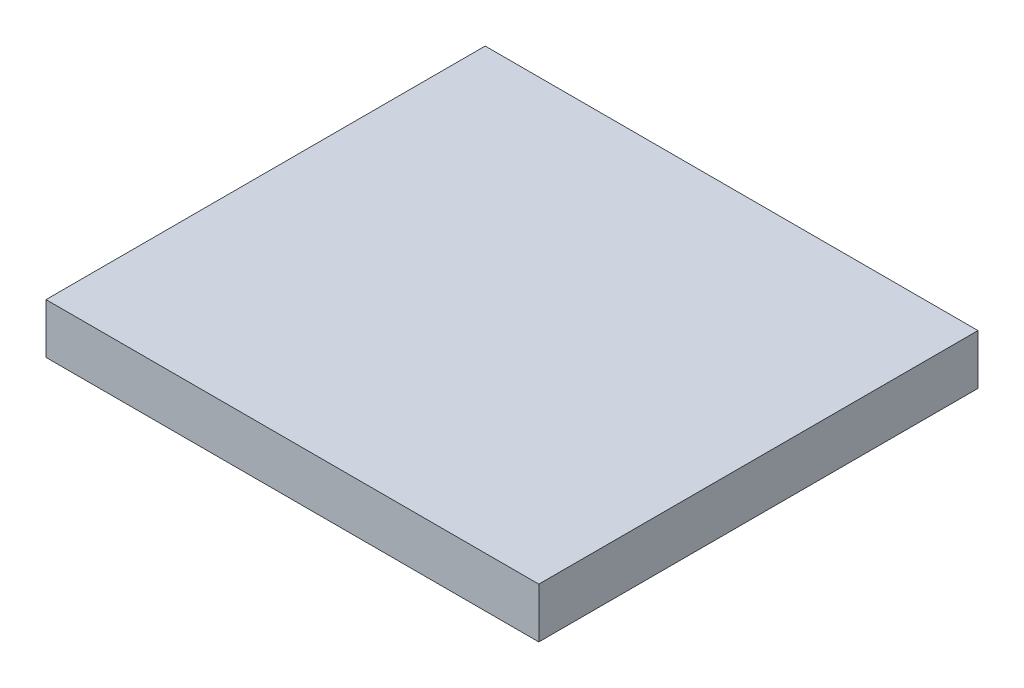
ISO-10303-21;
HEADER;
FILE_DESCRIPTION(('STEP AP214'),'2;1');
FILE_NAME('part.step','',(''),(''),'','','');
FILE_SCHEMA(('AUTOMOTIVE_DESIGN { 1 0 10303 214 1 1 1 1 }'));
ENDSEC;
DATA;
#1=APPLICATION_CONTEXT('core data for automotive mechanical design processes');
#2=APPLICATION_PROTOCOL_DEFINITION('international standard','automotive_design',2000,#1);
#3=PRODUCT_CONTEXT('',#1,'mechanical');
#4=PRODUCT('Part','Part','',(#3));
#5=PRODUCT_RELATED_PRODUCT_CATEGORY('part','',(#4));
#6=PRODUCT_DEFINITION_FORMATION('','',#4);
#7=PRODUCT_DEFINITION_CONTEXT('part definition',#1,'design');
#8=PRODUCT_DEFINITION('design','',#6,#7);
#9=PRODUCT_DEFINITION_SHAPE('','',#8);
#10=(LENGTH_UNIT() NAMED_UNIT(*) SI_UNIT(.MILLI.,.METRE.));
#11=(NAMED_UNIT(*) PLANE_ANGLE_UNIT() SI_UNIT($,.RADIAN.));
#12=(NAMED_UNIT(*) SI_UNIT($,.STERADIAN.) SOLID_ANGLE_UNIT());
#13=UNCERTAINTY_MEASURE_WITH_UNIT(LENGTH_MEASURE(1.E-05),#10,'distance_accuracy_value','');
#14=(GEOMETRIC_REPRESENTATION_CONTEXT(3) GLOBAL_UNCERTAINTY_ASSIGNED_CONTEXT((#13)) GLOBAL_UNIT_ASSIGNED_CONTEXT((#10,
#11,#12)) REPRESENTATION_CONTEXT('',''));
#15=CARTESIAN_POINT('',(0.,0.,0.));
#16=DIRECTION('',(0.,0.,1.));
#17=DIRECTION('',(1.,0.,0.));
#18=AXIS2_PLACEMENT_3D('',#15,#16,#17);
#19=CARTESIAN_POINT('',(-1.66533453693773E-12,-1.49999999999872,4.44089209850063E-13));
#20=DIRECTION('',(1.40345746602276E-13,0.,0.999999999999986));
#21=DIRECTION('',(0.999999999999992,0.,-1.39161896106967E-13));
#22=AXIS2_PLACEMENT_3D('',#19,#20,#21);
#23=PLANE('',#22);
#24=DIRECTION('',(0.999999999999992,0.,-1.39161896106967E-13));
#25=VECTOR('',#24,1.);
#26=CARTESIAN_POINT('',(3.33066907387547E-13,8.88178419700125E-13,-1.11022302462516E-13));
#27=LINE('',#26,#25);
#28=CARTESIAN_POINT('',(3.33066907387547E-13,8.88178419700125E-13,-1.11022302462516E-13));
#29=VERTEX_POINT('',#28);
#30=CARTESIAN_POINT('',(14.75576731971,2.22044604925031E-13,-2.72004641033163E-12));
#31=VERTEX_POINT('',#30);
#32=EDGE_CURVE('E98',#29,#31,#27,.T.);
#33=ORIENTED_EDGE('',*,*,#32,.F.);
#34=DIRECTION('',(0.,1.,0.));
#35=VECTOR('',#34,1.);
#36=CARTESIAN_POINT('',(-1.66533453693773E-12,-1.49999999999872,4.44089209850063E-13));
#37=LINE('',#36,#35);
#38=CARTESIAN_POINT('',(-1.66533453693773E-12,-1.49999999999872,4.44089209850063E-13));
#39=VERTEX_POINT('',#38);
#40=EDGE_CURVE('E11',#39,#29,#37,.T.);
#41=ORIENTED_EDGE('',*,*,#40,.F.);
#42=DIRECTION('',(0.999999999999992,0.,-1.39161896106967E-13));
#43=VECTOR('',#42,1.);
#44=CARTESIAN_POINT('',(-1.66533453693773E-12,-1.49999999999872,4.44089209850063E-13));
#45=LINE('',#44,#43);
#46=CARTESIAN_POINT('',(14.755767319708,-1.49999999999717,-2.22044604925031E-12));
#47=VERTEX_POINT('',#46);
#48=EDGE_CURVE('E92',#39,#47,#45,.T.);
#49=ORIENTED_EDGE('',*,*,#48,.T.);
#50=DIRECTION('',(0.,1.,0.));
#51=VECTOR('',#50,1.);
#52=CARTESIAN_POINT('',(14.755767319708,-1.49999999999717,-2.22044604925031E-12));
#53=LINE('',#52,#51);
#54=EDGE_CURVE('E37',#47,#31,#53,.T.);
#55=ORIENTED_EDGE('',*,*,#54,.T.);
#56=EDGE_LOOP('',(#33,#41,#49,#55));
#57=FACE_BOUND('',#56,.T.);
#58=ADVANCED_FACE('F34',(#57),#23,.T.);
#59=CARTESIAN_POINT('',(-2.55351295663786E-12,-1.49999999999983,-13.149930718609));
#60=DIRECTION('',(-0.999999999999992,0.,0.));
#61=DIRECTION('',(0.,0.,0.999999999999986));
#62=AXIS2_PLACEMENT_3D('',#59,#60,#61);
#63=PLANE('',#62);
#64=DIRECTION('',(0.,0.,0.999999999999986));
#65=VECTOR('',#64,1.);
#66=CARTESIAN_POINT('',(3.33066907387547E-13,6.66133814775094E-13,-13.1499307186086));
#67=LINE('',#66,#65);
#68=CARTESIAN_POINT('',(3.33066907387547E-13,6.66133814775094E-13,-13.1499307186086));
#69=VERTEX_POINT('',#68);
#70=EDGE_CURVE('E94',#69,#29,#67,.T.);
#71=ORIENTED_EDGE('',*,*,#70,.F.);
#72=DIRECTION('',(0.,1.,0.));
#73=VECTOR('',#72,1.);
#74=CARTESIAN_POINT('',(-2.55351295663786E-12,-1.49999999999983,-13.149930718609));
#75=LINE('',#74,#73);
#76=CARTESIAN_POINT('',(-2.55351295663786E-12,-1.49999999999983,-13.149930718609));
#77=VERTEX_POINT('',#76);
#78=EDGE_CURVE('E43',#77,#69,#75,.T.);
#79=ORIENTED_EDGE('',*,*,#78,.F.);
#80=DIRECTION('',(0.,0.,0.999999999999986));
#81=VECTOR('',#80,1.);
#82=CARTESIAN_POINT('',(-2.55351295663786E-12,-1.49999999999983,-13.149930718609));
#83=LINE('',#82,#81);
#84=EDGE_CURVE('E89',#77,#39,#83,.T.);
#85=ORIENTED_EDGE('',*,*,#84,.T.);
#86=ORIENTED_EDGE('',*,*,#40,.T.);
#87=EDGE_LOOP('',(#71,#79,#85,#86));
#88=FACE_BOUND('',#87,.T.);
#89=ADVANCED_FACE('F108',(#88),#63,.T.);
#90=CARTESIAN_POINT('',(-2.55351295663786E-12,-1.49999999999983,-13.149930718609));
#91=DIRECTION('',(-1.40345746602276E-13,0.,-0.999999999999986));
#92=DIRECTION('',(-0.999999999999992,0.,1.39161896106967E-13));
#93=AXIS2_PLACEMENT_3D('',#90,#91,#92);
#94=PLANE('',#93);
#95=DIRECTION('',(-0.999999999999992,0.,1.39161896106967E-13));
#96=VECTOR('',#95,1.);
#97=CARTESIAN_POINT('',(3.33066907387547E-13,6.66133814775094E-13,-13.1499307186086));
#98=LINE('',#97,#96);
#99=CARTESIAN_POINT('',(14.75576731971,1.11022302462516E-12,-13.1499307186113));
#100=VERTEX_POINT('',#99);
#101=EDGE_CURVE('E84',#100,#69,#98,.T.);
#102=ORIENTED_EDGE('',*,*,#101,.F.);
#103=DIRECTION('',(0.,1.,0.));
#104=VECTOR('',#103,1.);
#105=CARTESIAN_POINT('',(14.7557673197071,-1.49999999999828,-13.1499307186119));
#106=LINE('',#105,#104);
#107=CARTESIAN_POINT('',(14.7557673197071,-1.49999999999828,-13.1499307186119));
#108=VERTEX_POINT('',#107);
#109=EDGE_CURVE('E79',#108,#100,#106,.T.);
#110=ORIENTED_EDGE('',*,*,#109,.F.);
#111=DIRECTION('',(-0.999999999999992,0.,1.39161896106967E-13));
#112=VECTOR('',#111,1.);
#113=CARTESIAN_POINT('',(-2.55351295663786E-12,-1.49999999999983,-13.149930718609));
#114=LINE('',#113,#112);
#115=EDGE_CURVE('E82',#108,#77,#114,.T.);
#116=ORIENTED_EDGE('',*,*,#115,.T.);
#117=ORIENTED_EDGE('',*,*,#78,.T.);
#118=EDGE_LOOP('',(#102,#110,#116,#117));
#119=FACE_BOUND('',#118,.T.);
#120=ADVANCED_FACE('F81',(#119),#94,.T.);
#121=CARTESIAN_POINT('',(14.755767319708,-1.49999999999717,-2.22044604925031E-12));
#122=DIRECTION('',(0.999999999999992,0.,0.));
#123=DIRECTION('',(0.,0.,-0.999999999999986));
#124=AXIS2_PLACEMENT_3D('',#121,#122,#123);
#125=PLANE('',#124);
#126=DIRECTION('',(0.,0.,-0.999999999999986));
#127=VECTOR('',#126,1.);
#128=CARTESIAN_POINT('',(14.75576731971,2.22044604925031E-13,-2.72004641033163E-12));
#129=LINE('',#128,#127);
#130=EDGE_CURVE('E101',#31,#100,#129,.T.);
#131=ORIENTED_EDGE('',*,*,#130,.F.);
#132=ORIENTED_EDGE('',*,*,#54,.F.);
#133=DIRECTION('',(0.,0.,-0.999999999999986));
#134=VECTOR('',#133,1.);
#135=CARTESIAN_POINT('',(14.755767319708,-1.49999999999717,-2.22044604925031E-12));
#136=LINE('',#135,#134);
#137=EDGE_CURVE('E88',#47,#108,#136,.T.);
#138=ORIENTED_EDGE('',*,*,#137,.T.);
#139=ORIENTED_EDGE('',*,*,#109,.T.);
#140=EDGE_LOOP('',(#131,#132,#138,#139));
#141=FACE_BOUND('',#140,.T.);
#142=ADVANCED_FACE('F91',(#141),#125,.T.);
#143=CARTESIAN_POINT('',(-1.99840144432528E-12,-1.49999999999872,4.44089209850063E-13));
#144=DIRECTION('',(0.,1.,0.));
#145=DIRECTION('',(0.,0.,0.999999999999986));
#146=AXIS2_PLACEMENT_3D('',#143,#144,#145);
#147=PLANE('',#146);
#148=ORIENTED_EDGE('',*,*,#48,.F.);
#149=ORIENTED_EDGE('',*,*,#84,.F.);
#150=ORIENTED_EDGE('',*,*,#115,.F.);
#151=ORIENTED_EDGE('',*,*,#137,.F.);
#152=EDGE_LOOP('',(#148,#149,#150,#151));
#153=FACE_BOUND('',#152,.T.);
#154=ADVANCED_FACE('F87',(#153),#147,.F.);
#155=CARTESIAN_POINT('',(0.,0.,0.));
#156=DIRECTION('',(0.,1.,0.));
#157=DIRECTION('',(0.,0.,0.999999999999986));
#158=AXIS2_PLACEMENT_3D('',#155,#156,#157);
#159=PLANE('',#158);
#160=ORIENTED_EDGE('',*,*,#32,.T.);
#161=ORIENTED_EDGE('',*,*,#130,.T.);
#162=ORIENTED_EDGE('',*,*,#101,.T.);
#163=ORIENTED_EDGE('',*,*,#70,.T.);
#164=EDGE_LOOP('',(#160,#161,#162,#163));
#165=FACE_BOUND('',#164,.T.);
#166=ADVANCED_FACE('F107',(#165),#159,.T.);
#167=CLOSED_SHELL('',(#58,#89,#120,#142,#154,#166));
#168=MANIFOLD_SOLID_BREP('B2',#167);
#169=ADVANCED_BREP_SHAPE_REPRESENTATION('',(#18,#168),#14);
#170=SHAPE_DEFINITION_REPRESENTATION(#9,#169);
ENDSEC;
END-ISO-10303-21;
